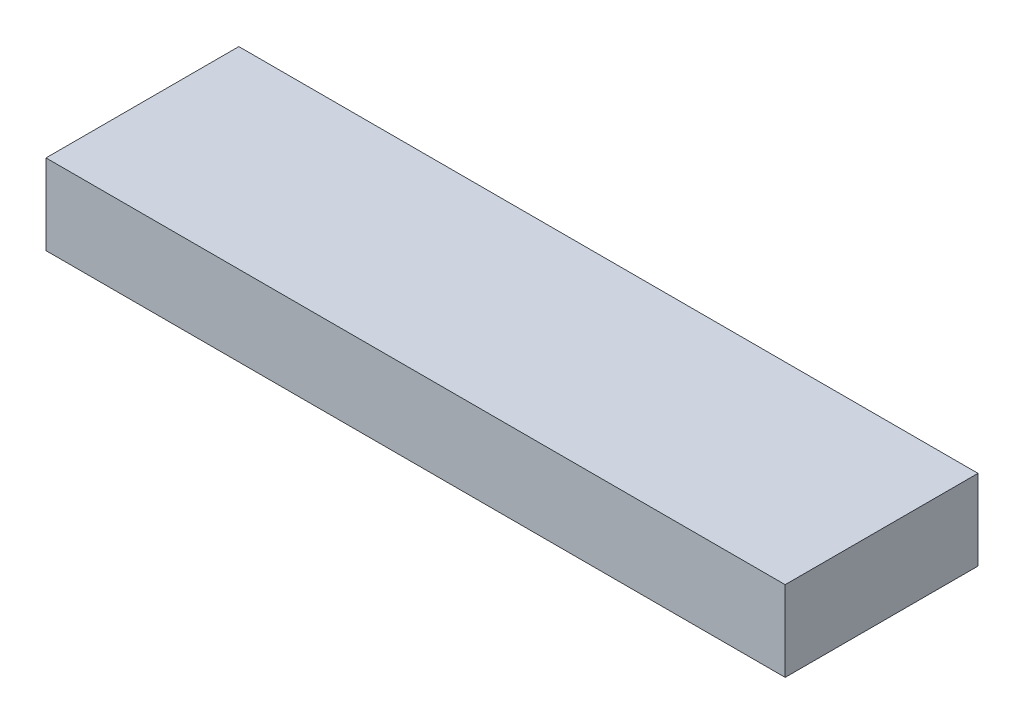
ISO-10303-21;
HEADER;
FILE_DESCRIPTION(('STEP AP214'),'2;1');
FILE_NAME('part.step','',(''),(''),'','','');
FILE_SCHEMA(('AUTOMOTIVE_DESIGN { 1 0 10303 214 1 1 1 1 }'));
ENDSEC;
DATA;
#1=APPLICATION_CONTEXT('core data for automotive mechanical design processes');
#2=APPLICATION_PROTOCOL_DEFINITION('international standard','automotive_design',2000,#1);
#3=PRODUCT_CONTEXT('',#1,'mechanical');
#4=PRODUCT('Part','Part','',(#3));
#5=PRODUCT_RELATED_PRODUCT_CATEGORY('part','',(#4));
#6=PRODUCT_DEFINITION_FORMATION('','',#4);
#7=PRODUCT_DEFINITION_CONTEXT('part definition',#1,'design');
#8=PRODUCT_DEFINITION('design','',#6,#7);
#9=PRODUCT_DEFINITION_SHAPE('','',#8);
#10=(LENGTH_UNIT() NAMED_UNIT(*) SI_UNIT(.MILLI.,.METRE.));
#11=(NAMED_UNIT(*) PLANE_ANGLE_UNIT() SI_UNIT($,.RADIAN.));
#12=(NAMED_UNIT(*) SI_UNIT($,.STERADIAN.) SOLID_ANGLE_UNIT());
#13=UNCERTAINTY_MEASURE_WITH_UNIT(LENGTH_MEASURE(1.E-05),#10,'distance_accuracy_value','');
#14=(GEOMETRIC_REPRESENTATION_CONTEXT(3) GLOBAL_UNCERTAINTY_ASSIGNED_CONTEXT((#13)) GLOBAL_UNIT_ASSIGNED_CONTEXT((#10,
#11,#12)) REPRESENTATION_CONTEXT('',''));
#15=CARTESIAN_POINT('',(0.,0.,0.));
#16=DIRECTION('',(0.,0.,1.));
#17=DIRECTION('',(1.,0.,0.));
#18=AXIS2_PLACEMENT_3D('',#15,#16,#17);
#19=CARTESIAN_POINT('',(-14.6428571428571,5.,-10.5));
#20=DIRECTION('',(1.,0.,0.));
#21=DIRECTION('',(0.,0.,-1.));
#22=AXIS2_PLACEMENT_3D('',#19,#20,#21);
#23=PLANE('',#22);
#24=DIRECTION('',(0.,0.,1.));
#25=VECTOR('',#24,1.);
#26=CARTESIAN_POINT('',(-14.6428571428571,0.,-10.5));
#27=LINE('',#26,#25);
#28=CARTESIAN_POINT('',(-14.6428571428571,0.,-10.5));
#29=VERTEX_POINT('',#28);
#30=CARTESIAN_POINT('',(-14.6428571428571,0.,1.5));
#31=VERTEX_POINT('',#30);
#32=EDGE_CURVE('E111',#29,#31,#27,.T.);
#33=ORIENTED_EDGE('',*,*,#32,.T.);
#34=DIRECTION('',(0.,-1.,0.));
#35=VECTOR('',#34,1.);
#36=CARTESIAN_POINT('',(-14.6428571428571,5.,1.5));
#37=LINE('',#36,#35);
#38=CARTESIAN_POINT('',(-14.6428571428571,5.,1.5));
#39=VERTEX_POINT('',#38);
#40=EDGE_CURVE('E11',#39,#31,#37,.T.);
#41=ORIENTED_EDGE('',*,*,#40,.F.);
#42=DIRECTION('',(0.,0.,1.));
#43=VECTOR('',#42,1.);
#44=CARTESIAN_POINT('',(-14.6428571428571,5.,-10.5));
#45=LINE('',#44,#43);
#46=CARTESIAN_POINT('',(-14.6428571428571,5.,-10.5));
#47=VERTEX_POINT('',#46);
#48=EDGE_CURVE('E95',#47,#39,#45,.T.);
#49=ORIENTED_EDGE('',*,*,#48,.F.);
#50=DIRECTION('',(0.,-1.,0.));
#51=VECTOR('',#50,1.);
#52=CARTESIAN_POINT('',(-14.6428571428571,5.,-10.5));
#53=LINE('',#52,#51);
#54=EDGE_CURVE('E107',#47,#29,#53,.T.);
#55=ORIENTED_EDGE('',*,*,#54,.T.);
#56=EDGE_LOOP('',(#33,#41,#49,#55));
#57=FACE_BOUND('',#56,.T.);
#58=ADVANCED_FACE('F43',(#57),#23,.F.);
#59=CARTESIAN_POINT('',(-14.6428571428571,5.,1.5));
#60=DIRECTION('',(0.,0.,-1.));
#61=DIRECTION('',(-1.,0.,0.));
#62=AXIS2_PLACEMENT_3D('',#59,#60,#61);
#63=PLANE('',#62);
#64=DIRECTION('',(1.,0.,0.));
#65=VECTOR('',#64,1.);
#66=CARTESIAN_POINT('',(-14.6428571428571,0.,1.5));
#67=LINE('',#66,#65);
#68=CARTESIAN_POINT('',(31.3571428571429,0.,1.5));
#69=VERTEX_POINT('',#68);
#70=EDGE_CURVE('E100',#31,#69,#67,.T.);
#71=ORIENTED_EDGE('',*,*,#70,.T.);
#72=DIRECTION('',(0.,-1.,0.));
#73=VECTOR('',#72,1.);
#74=CARTESIAN_POINT('',(31.3571428571429,5.,1.5));
#75=LINE('',#74,#73);
#76=CARTESIAN_POINT('',(31.3571428571429,5.,1.5));
#77=VERTEX_POINT('',#76);
#78=EDGE_CURVE('E52',#77,#69,#75,.T.);
#79=ORIENTED_EDGE('',*,*,#78,.F.);
#80=DIRECTION('',(1.,0.,0.));
#81=VECTOR('',#80,1.);
#82=CARTESIAN_POINT('',(-14.6428571428571,5.,1.5));
#83=LINE('',#82,#81);
#84=EDGE_CURVE('E90',#39,#77,#83,.T.);
#85=ORIENTED_EDGE('',*,*,#84,.F.);
#86=ORIENTED_EDGE('',*,*,#40,.T.);
#87=EDGE_LOOP('',(#71,#79,#85,#86));
#88=FACE_BOUND('',#87,.T.);
#89=ADVANCED_FACE('F99',(#88),#63,.F.);
#90=CARTESIAN_POINT('',(31.3571428571429,5.,-10.5));
#91=DIRECTION('',(-1.,0.,0.));
#92=DIRECTION('',(0.,0.,1.));
#93=AXIS2_PLACEMENT_3D('',#90,#91,#92);
#94=PLANE('',#93);
#95=DIRECTION('',(0.,0.,-1.));
#96=VECTOR('',#95,1.);
#97=CARTESIAN_POINT('',(31.3571428571429,0.,-10.5));
#98=LINE('',#97,#96);
#99=CARTESIAN_POINT('',(31.3571428571429,0.,-10.5));
#100=VERTEX_POINT('',#99);
#101=EDGE_CURVE('E77',#69,#100,#98,.T.);
#102=ORIENTED_EDGE('',*,*,#101,.T.);
#103=DIRECTION('',(0.,-1.,0.));
#104=VECTOR('',#103,1.);
#105=CARTESIAN_POINT('',(31.3571428571429,5.,-10.5));
#106=LINE('',#105,#104);
#107=CARTESIAN_POINT('',(31.3571428571429,5.,-10.5));
#108=VERTEX_POINT('',#107);
#109=EDGE_CURVE('E102',#108,#100,#106,.T.);
#110=ORIENTED_EDGE('',*,*,#109,.F.);
#111=DIRECTION('',(0.,0.,-1.));
#112=VECTOR('',#111,1.);
#113=CARTESIAN_POINT('',(31.3571428571429,5.,-10.5));
#114=LINE('',#113,#112);
#115=EDGE_CURVE('E93',#77,#108,#114,.T.);
#116=ORIENTED_EDGE('',*,*,#115,.F.);
#117=ORIENTED_EDGE('',*,*,#78,.T.);
#118=EDGE_LOOP('',(#102,#110,#116,#117));
#119=FACE_BOUND('',#118,.T.);
#120=ADVANCED_FACE('F103',(#119),#94,.F.);
#121=CARTESIAN_POINT('',(-14.6428571428571,5.,-10.5));
#122=DIRECTION('',(0.,0.,1.));
#123=DIRECTION('',(1.,0.,0.));
#124=AXIS2_PLACEMENT_3D('',#121,#122,#123);
#125=PLANE('',#124);
#126=DIRECTION('',(-1.,0.,0.));
#127=VECTOR('',#126,1.);
#128=CARTESIAN_POINT('',(-14.6428571428571,0.,-10.5));
#129=LINE('',#128,#127);
#130=EDGE_CURVE('E83',#100,#29,#129,.T.);
#131=ORIENTED_EDGE('',*,*,#130,.T.);
#132=ORIENTED_EDGE('',*,*,#54,.F.);
#133=DIRECTION('',(-1.,0.,0.));
#134=VECTOR('',#133,1.);
#135=CARTESIAN_POINT('',(-14.6428571428571,5.,-10.5));
#136=LINE('',#135,#134);
#137=EDGE_CURVE('E60',#108,#47,#136,.T.);
#138=ORIENTED_EDGE('',*,*,#137,.F.);
#139=ORIENTED_EDGE('',*,*,#109,.T.);
#140=EDGE_LOOP('',(#131,#132,#138,#139));
#141=FACE_BOUND('',#140,.T.);
#142=ADVANCED_FACE('F124',(#141),#125,.F.);
#143=CARTESIAN_POINT('',(0.,5.,0.));
#144=DIRECTION('',(0.,1.,0.));
#145=DIRECTION('',(0.,0.,1.));
#146=AXIS2_PLACEMENT_3D('',#143,#144,#145);
#147=PLANE('',#146);
#148=ORIENTED_EDGE('',*,*,#48,.T.);
#149=ORIENTED_EDGE('',*,*,#84,.T.);
#150=ORIENTED_EDGE('',*,*,#115,.T.);
#151=ORIENTED_EDGE('',*,*,#137,.T.);
#152=EDGE_LOOP('',(#148,#149,#150,#151));
#153=FACE_BOUND('',#152,.T.);
#154=ADVANCED_FACE('F91',(#153),#147,.T.);
#155=CARTESIAN_POINT('',(0.,0.,0.));
#156=DIRECTION('',(0.,1.,0.));
#157=DIRECTION('',(0.,0.,1.));
#158=AXIS2_PLACEMENT_3D('',#155,#156,#157);
#159=PLANE('',#158);
#160=ORIENTED_EDGE('',*,*,#32,.F.);
#161=ORIENTED_EDGE('',*,*,#130,.F.);
#162=ORIENTED_EDGE('',*,*,#101,.F.);
#163=ORIENTED_EDGE('',*,*,#70,.F.);
#164=EDGE_LOOP('',(#160,#161,#162,#163));
#165=FACE_BOUND('',#164,.T.);
#166=ADVANCED_FACE('F127',(#165),#159,.F.);
#167=CLOSED_SHELL('',(#58,#89,#120,#142,#154,#166));
#168=MANIFOLD_SOLID_BREP('B2',#167);
#169=ADVANCED_BREP_SHAPE_REPRESENTATION('',(#18,#168),#14);
#170=SHAPE_DEFINITION_REPRESENTATION(#9,#169);
ENDSEC;
END-ISO-10303-21;
